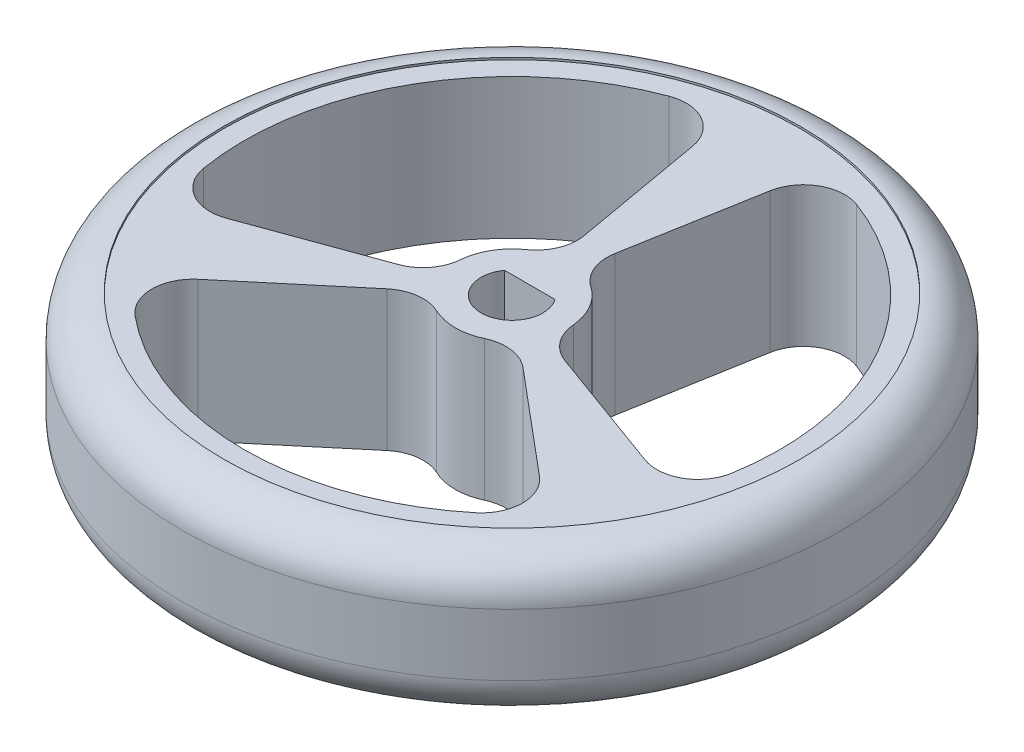
ISO-10303-21;
HEADER;
FILE_DESCRIPTION(('STEP AP214'),'2;1');
FILE_NAME('part.step','',(''),(''),'','','');
FILE_SCHEMA(('AUTOMOTIVE_DESIGN { 1 0 10303 214 1 1 1 1 }'));
ENDSEC;
DATA;
#1=APPLICATION_CONTEXT('core data for automotive mechanical design processes');
#2=APPLICATION_PROTOCOL_DEFINITION('international standard','automotive_design',2000,#1);
#3=PRODUCT_CONTEXT('',#1,'mechanical');
#4=PRODUCT('Part','Part','',(#3));
#5=PRODUCT_RELATED_PRODUCT_CATEGORY('part','',(#4));
#6=PRODUCT_DEFINITION_FORMATION('','',#4);
#7=PRODUCT_DEFINITION_CONTEXT('part definition',#1,'design');
#8=PRODUCT_DEFINITION('design','',#6,#7);
#9=PRODUCT_DEFINITION_SHAPE('','',#8);
#10=(LENGTH_UNIT() NAMED_UNIT(*) SI_UNIT(.MILLI.,.METRE.));
#11=(NAMED_UNIT(*) PLANE_ANGLE_UNIT() SI_UNIT($,.RADIAN.));
#12=(NAMED_UNIT(*) SI_UNIT($,.STERADIAN.) SOLID_ANGLE_UNIT());
#13=UNCERTAINTY_MEASURE_WITH_UNIT(LENGTH_MEASURE(1.E-05),#10,'distance_accuracy_value','');
#14=(GEOMETRIC_REPRESENTATION_CONTEXT(3) GLOBAL_UNCERTAINTY_ASSIGNED_CONTEXT((#13)) GLOBAL_UNIT_ASSIGNED_CONTEXT((#10,
#11,#12)) REPRESENTATION_CONTEXT('',''));
#15=CARTESIAN_POINT('',(0.,0.,0.));
#16=DIRECTION('',(0.,0.,1.));
#17=DIRECTION('',(1.,0.,0.));
#18=AXIS2_PLACEMENT_3D('',#15,#16,#17);
#19=CARTESIAN_POINT('',(0.,3.5,0.));
#20=DIRECTION('',(0.,-1.,0.));
#21=DIRECTION('',(0.,0.,-1.));
#22=AXIS2_PLACEMENT_3D('',#19,#20,#21);
#23=CYLINDRICAL_SURFACE('',#22,1.5);
#24=DIRECTION('',(0.,-1.,0.));
#25=VECTOR('',#24,1.);
#26=CARTESIAN_POINT('',(1.22723011289652,3.5,-0.8625));
#27=LINE('',#26,#25);
#28=CARTESIAN_POINT('',(1.22723011289652,3.4,-0.8625));
#29=VERTEX_POINT('',#28);
#30=CARTESIAN_POINT('',(1.22723011289652,-3.4,-0.8625));
#31=VERTEX_POINT('',#30);
#32=EDGE_CURVE('E373',#29,#31,#27,.T.);
#33=ORIENTED_EDGE('',*,*,#32,.T.);
#34=CARTESIAN_POINT('',(0.,-3.4,0.));
#35=DIRECTION('',(0.,-1.,0.));
#36=DIRECTION('',(0.,0.,-1.));
#37=AXIS2_PLACEMENT_3D('',#34,#35,#36);
#38=CIRCLE('',#37,1.5);
#39=CARTESIAN_POINT('',(-1.22723011289652,-3.4,-0.8625));
#40=VERTEX_POINT('',#39);
#41=EDGE_CURVE('E60',#31,#40,#38,.T.);
#42=ORIENTED_EDGE('',*,*,#41,.T.);
#43=DIRECTION('',(0.,-1.,0.));
#44=VECTOR('',#43,1.);
#45=CARTESIAN_POINT('',(-1.22723011289652,3.5,-0.8625));
#46=LINE('',#45,#44);
#47=CARTESIAN_POINT('',(-1.22723011289652,3.4,-0.8625));
#48=VERTEX_POINT('',#47);
#49=EDGE_CURVE('E376',#48,#40,#46,.T.);
#50=ORIENTED_EDGE('',*,*,#49,.F.);
#51=CARTESIAN_POINT('',(0.,3.4,0.));
#52=DIRECTION('',(0.,1.,0.));
#53=DIRECTION('',(0.,0.,1.));
#54=AXIS2_PLACEMENT_3D('',#51,#52,#53);
#55=CIRCLE('',#54,1.5);
#56=EDGE_CURVE('E370',#48,#29,#55,.T.);
#57=ORIENTED_EDGE('',*,*,#56,.T.);
#58=EDGE_LOOP('',(#33,#42,#50,#57));
#59=FACE_BOUND('',#58,.T.);
#60=ADVANCED_FACE('F46',(#59),#23,.F.);
#61=CARTESIAN_POINT('',(0.,3.5,0.));
#62=DIRECTION('',(0.,-1.,0.));
#63=DIRECTION('',(0.,0.,-1.));
#64=AXIS2_PLACEMENT_3D('',#61,#62,#63);
#65=CYLINDRICAL_SURFACE('',#64,2.75);
#66=CARTESIAN_POINT('',(0.,-3.4,0.));
#67=DIRECTION('',(0.,-1.,0.));
#68=DIRECTION('',(0.,0.,-1.));
#69=AXIS2_PLACEMENT_3D('',#66,#67,#68);
#70=CIRCLE('',#69,2.75);
#71=CARTESIAN_POINT('',(1.57344297134494,-3.4,-2.25538848448005));
#72=VERTEX_POINT('',#71);
#73=CARTESIAN_POINT('',(2.73994520863507,-3.4,-0.234947342350827));
#74=VERTEX_POINT('',#73);
#75=EDGE_CURVE('E424',#72,#74,#70,.T.);
#76=ORIENTED_EDGE('',*,*,#75,.F.);
#77=DIRECTION('',(0.,-1.,0.));
#78=VECTOR('',#77,1.);
#79=CARTESIAN_POINT('',(1.57344297134494,3.5,-2.25538848448005));
#80=LINE('',#79,#78);
#81=CARTESIAN_POINT('',(1.57344297134494,3.4,-2.25538848448005));
#82=VERTEX_POINT('',#81);
#83=EDGE_CURVE('E288',#72,#82,#80,.F.);
#84=ORIENTED_EDGE('',*,*,#83,.T.);
#85=CARTESIAN_POINT('',(0.,3.4,0.));
#86=DIRECTION('',(0.,1.,0.));
#87=DIRECTION('',(0.,0.,1.));
#88=AXIS2_PLACEMENT_3D('',#85,#86,#87);
#89=CIRCLE('',#88,2.75);
#90=CARTESIAN_POINT('',(2.73994520863507,3.4,-0.234947342350827));
#91=VERTEX_POINT('',#90);
#92=EDGE_CURVE('E363',#91,#82,#89,.T.);
#93=ORIENTED_EDGE('',*,*,#92,.F.);
#94=DIRECTION('',(0.,-1.,0.));
#95=VECTOR('',#94,1.);
#96=CARTESIAN_POINT('',(2.73994520863507,3.5,-0.234947342350827));
#97=LINE('',#96,#95);
#98=EDGE_CURVE('E290',#91,#74,#97,.T.);
#99=ORIENTED_EDGE('',*,*,#98,.T.);
#100=EDGE_LOOP('',(#76,#84,#93,#99));
#101=FACE_BOUND('',#100,.T.);
#102=ADVANCED_FACE('F483',(#101),#65,.T.);
#103=CARTESIAN_POINT('',(0.,3.5,0.));
#104=DIRECTION('',(-0.984807753012207,0.,-0.173648177666938));
#105=DIRECTION('',(-0.173648177666938,0.,0.984807753012207));
#106=AXIS2_PLACEMENT_3D('',#103,#104,#105);
#107=PLANE('',#106);
#108=DIRECTION('',(-0.173648177666938,0.,0.984807753012207));
#109=VECTOR('',#108,1.);
#110=CARTESIAN_POINT('',(0.,-3.4,0.));
#111=LINE('',#110,#109);
#112=CARTESIAN_POINT('',(1.87829222540707,-3.4,-10.65232454988));
#113=VERTEX_POINT('',#112);
#114=CARTESIAN_POINT('',(0.748149626298667,-3.4,-4.24296737398123));
#115=VERTEX_POINT('',#114);
#116=EDGE_CURVE('E426',#113,#115,#111,.T.);
#117=ORIENTED_EDGE('',*,*,#116,.F.);
#118=DIRECTION('',(0.,-1.,0.));
#119=VECTOR('',#118,1.);
#120=CARTESIAN_POINT('',(1.87829222540707,3.5,-10.65232454988));
#121=LINE('',#120,#119);
#122=CARTESIAN_POINT('',(1.87829222540707,3.4,-10.65232454988));
#123=VERTEX_POINT('',#122);
#124=EDGE_CURVE('E298',#113,#123,#121,.F.);
#125=ORIENTED_EDGE('',*,*,#124,.T.);
#126=DIRECTION('',(0.173648177666938,0.,-0.984807753012207));
#127=VECTOR('',#126,1.);
#128=CARTESIAN_POINT('',(0.,3.4,0.));
#129=LINE('',#128,#127);
#130=CARTESIAN_POINT('',(0.748149626298667,3.4,-4.24296737398123));
#131=VERTEX_POINT('',#130);
#132=EDGE_CURVE('E360',#131,#123,#129,.T.);
#133=ORIENTED_EDGE('',*,*,#132,.F.);
#134=DIRECTION('',(0.,1.,0.));
#135=VECTOR('',#134,1.);
#136=CARTESIAN_POINT('',(0.748149626298667,-3.5,-4.24296737398123));
#137=LINE('',#136,#135);
#138=EDGE_CURVE('E300',#131,#115,#137,.F.);
#139=ORIENTED_EDGE('',*,*,#138,.T.);
#140=EDGE_LOOP('',(#117,#125,#133,#139));
#141=FACE_BOUND('',#140,.T.);
#142=ADVANCED_FACE('F489',(#141),#107,.F.);
#143=CARTESIAN_POINT('',(0.,3.5,0.));
#144=DIRECTION('',(0.,-1.,0.));
#145=DIRECTION('',(0.,0.,-1.));
#146=AXIS2_PLACEMENT_3D('',#143,#144,#145);
#147=CYLINDRICAL_SURFACE('',#146,13.);
#148=DIRECTION('',(0.,-1.,0.));
#149=VECTOR('',#148,1.);
#150=CARTESIAN_POINT('',(4.54752731896448,3.5,-12.1786696844636));
#151=LINE('',#150,#149);
#152=CARTESIAN_POINT('',(4.54752731896448,3.4,-12.1786696844636));
#153=VERTEX_POINT('',#152);
#154=CARTESIAN_POINT('',(4.54752731896448,-3.4,-12.1786696844636));
#155=VERTEX_POINT('',#154);
#156=EDGE_CURVE('E305',#153,#155,#151,.T.);
#157=ORIENTED_EDGE('',*,*,#156,.T.);
#158=CARTESIAN_POINT('',(0.,-3.4,0.));
#159=DIRECTION('',(0.,-1.,0.));
#160=DIRECTION('',(0.,0.,-1.));
#161=AXIS2_PLACEMENT_3D('',#158,#159,#160);
#162=CIRCLE('',#161,13.);
#163=CARTESIAN_POINT('',(12.8208009905271,-3.4,2.15106065960479));
#164=VERTEX_POINT('',#163);
#165=EDGE_CURVE('E432',#155,#164,#162,.T.);
#166=ORIENTED_EDGE('',*,*,#165,.T.);
#167=DIRECTION('',(0.,-1.,0.));
#168=VECTOR('',#167,1.);
#169=CARTESIAN_POINT('',(12.8208009905271,3.5,2.15106065960479));
#170=LINE('',#169,#168);
#171=CARTESIAN_POINT('',(12.8208009905271,3.4,2.15106065960479));
#172=VERTEX_POINT('',#171);
#173=EDGE_CURVE('E303',#164,#172,#170,.F.);
#174=ORIENTED_EDGE('',*,*,#173,.T.);
#175=CARTESIAN_POINT('',(0.,3.4,0.));
#176=DIRECTION('',(0.,1.,0.));
#177=DIRECTION('',(0.,0.,1.));
#178=AXIS2_PLACEMENT_3D('',#175,#176,#177);
#179=CIRCLE('',#178,13.);
#180=EDGE_CURVE('E353',#172,#153,#179,.T.);
#181=ORIENTED_EDGE('',*,*,#180,.T.);
#182=EDGE_LOOP('',(#157,#166,#174,#181));
#183=FACE_BOUND('',#182,.T.);
#184=ADVANCED_FACE('F506',(#183),#147,.F.);
#185=CARTESIAN_POINT('',(0.,3.5,0.));
#186=DIRECTION('',(-0.984807753012209,0.,0.173648177666924));
#187=DIRECTION('',(0.173648177666924,0.,0.984807753012209));
#188=AXIS2_PLACEMENT_3D('',#185,#186,#187);
#189=PLANE('',#188);
#190=DIRECTION('',(0.,1.,0.));
#191=VECTOR('',#190,1.);
#192=CARTESIAN_POINT('',(-1.87829222540692,-3.5,-10.65232454988));
#193=LINE('',#192,#191);
#194=CARTESIAN_POINT('',(-1.87829222540692,3.4,-10.65232454988));
#195=VERTEX_POINT('',#194);
#196=CARTESIAN_POINT('',(-1.87829222540692,-3.4,-10.65232454988));
#197=VERTEX_POINT('',#196);
#198=EDGE_CURVE('E255',#195,#197,#193,.F.);
#199=ORIENTED_EDGE('',*,*,#198,.T.);
#200=DIRECTION('',(0.173648177666924,0.,0.984807753012209));
#201=VECTOR('',#200,1.);
#202=CARTESIAN_POINT('',(0.,-3.4,0.));
#203=LINE('',#202,#201);
#204=CARTESIAN_POINT('',(-0.748149626298607,-3.4,-4.24296737398124));
#205=VERTEX_POINT('',#204);
#206=EDGE_CURVE('E222',#197,#205,#203,.T.);
#207=ORIENTED_EDGE('',*,*,#206,.T.);
#208=DIRECTION('',(0.,-1.,0.));
#209=VECTOR('',#208,1.);
#210=CARTESIAN_POINT('',(-0.748149626298607,3.5,-4.24296737398124));
#211=LINE('',#210,#209);
#212=CARTESIAN_POINT('',(-0.748149626298607,3.4,-4.24296737398124));
#213=VERTEX_POINT('',#212);
#214=EDGE_CURVE('E257',#205,#213,#211,.F.);
#215=ORIENTED_EDGE('',*,*,#214,.T.);
#216=DIRECTION('',(-0.173648177666924,0.,-0.984807753012209));
#217=VECTOR('',#216,1.);
#218=CARTESIAN_POINT('',(0.,3.4,0.));
#219=LINE('',#218,#217);
#220=EDGE_CURVE('E250',#213,#195,#219,.T.);
#221=ORIENTED_EDGE('',*,*,#220,.T.);
#222=EDGE_LOOP('',(#199,#207,#215,#221));
#223=FACE_BOUND('',#222,.T.);
#224=ADVANCED_FACE('F254',(#223),#189,.T.);
#225=CARTESIAN_POINT('',(0.,-3.4,0.));
#226=DIRECTION('',(0.,-1.,0.));
#227=DIRECTION('',(0.,0.,-1.));
#228=AXIS2_PLACEMENT_3D('',#225,#226,#227);
#229=CIRCLE('',#228,2.75);
#230=CARTESIAN_POINT('',(-2.73994520863508,-3.4,-0.234947342350669));
#231=VERTEX_POINT('',#230);
#232=CARTESIAN_POINT('',(-1.57344297134491,-3.4,-2.25538848448007));
#233=VERTEX_POINT('',#232);
#234=EDGE_CURVE('E391',#231,#233,#229,.T.);
#235=ORIENTED_EDGE('',*,*,#234,.F.);
#236=DIRECTION('',(0.,-1.,0.));
#237=VECTOR('',#236,1.);
#238=CARTESIAN_POINT('',(-2.73994520863508,3.5,-0.234947342350669));
#239=LINE('',#238,#237);
#240=CARTESIAN_POINT('',(-2.73994520863508,3.4,-0.234947342350669));
#241=VERTEX_POINT('',#240);
#242=EDGE_CURVE('E265',#231,#241,#239,.F.);
#243=ORIENTED_EDGE('',*,*,#242,.T.);
#244=CARTESIAN_POINT('',(0.,3.4,0.));
#245=DIRECTION('',(0.,1.,0.));
#246=DIRECTION('',(0.,0.,1.));
#247=AXIS2_PLACEMENT_3D('',#244,#245,#246);
#248=CIRCLE('',#247,2.75);
#249=CARTESIAN_POINT('',(-1.57344297134491,3.4,-2.25538848448007));
#250=VERTEX_POINT('',#249);
#251=EDGE_CURVE('E333',#250,#241,#248,.T.);
#252=ORIENTED_EDGE('',*,*,#251,.F.);
#253=DIRECTION('',(0.,-1.,0.));
#254=VECTOR('',#253,1.);
#255=CARTESIAN_POINT('',(-1.57344297134491,3.5,-2.25538848448007));
#256=LINE('',#255,#254);
#257=EDGE_CURVE('E260',#250,#233,#256,.T.);
#258=ORIENTED_EDGE('',*,*,#257,.T.);
#259=EDGE_LOOP('',(#235,#243,#252,#258));
#260=FACE_BOUND('',#259,.T.);
#261=ADVANCED_FACE('F389',(#260),#65,.T.);
#262=CARTESIAN_POINT('',(0.,3.5,1.4569079967223E-13));
#263=DIRECTION('',(0.342020143325662,0.,0.939692620785911));
#264=DIRECTION('',(0.939692620785911,0.,-0.342020143325662));
#265=AXIS2_PLACEMENT_3D('',#262,#263,#264);
#266=PLANE('',#265);
#267=DIRECTION('',(0.939692620785911,0.,-0.342020143325662));
#268=VECTOR('',#267,1.);
#269=CARTESIAN_POINT('',(0.,-3.4,1.4569079967223E-13));
#270=LINE('',#269,#268);
#271=CARTESIAN_POINT('',(-10.1643297822562,-3.4,3.6995134920068));
#272=VERTEX_POINT('',#271);
#273=CARTESIAN_POINT('',(-4.04859234644564,-3.4,1.4735671047843));
#274=VERTEX_POINT('',#273);
#275=EDGE_CURVE('E405',#272,#274,#270,.T.);
#276=ORIENTED_EDGE('',*,*,#275,.F.);
#277=DIRECTION('',(0.,-1.,0.));
#278=VECTOR('',#277,1.);
#279=CARTESIAN_POINT('',(-10.1643297822562,3.5,3.6995134920068));
#280=LINE('',#279,#278);
#281=CARTESIAN_POINT('',(-10.1643297822562,3.4,3.6995134920068));
#282=VERTEX_POINT('',#281);
#283=EDGE_CURVE('E262',#272,#282,#280,.F.);
#284=ORIENTED_EDGE('',*,*,#283,.T.);
#285=DIRECTION('',(-0.939692620785911,0.,0.342020143325662));
#286=VECTOR('',#285,1.);
#287=CARTESIAN_POINT('',(0.,3.4,1.4569079967223E-13));
#288=LINE('',#287,#286);
#289=CARTESIAN_POINT('',(-4.04859234644564,3.4,1.4735671047843));
#290=VERTEX_POINT('',#289);
#291=EDGE_CURVE('E398',#290,#282,#288,.T.);
#292=ORIENTED_EDGE('',*,*,#291,.F.);
#293=DIRECTION('',(0.,1.,0.));
#294=VECTOR('',#293,1.);
#295=CARTESIAN_POINT('',(-4.04859234644564,-3.5,1.4735671047843));
#296=LINE('',#295,#294);
#297=EDGE_CURVE('E270',#290,#274,#296,.F.);
#298=ORIENTED_EDGE('',*,*,#297,.T.);
#299=EDGE_LOOP('',(#276,#284,#292,#298));
#300=FACE_BOUND('',#299,.T.);
#301=ADVANCED_FACE('F404',(#300),#266,.F.);
#302=CARTESIAN_POINT('',(1.21820169157485E-13,3.5,1.45179624243869E-13));
#303=DIRECTION('',(0.642787609686534,0.,0.766044443118982));
#304=DIRECTION('',(0.766044443118982,0.,-0.642787609686534));
#305=AXIS2_PLACEMENT_3D('',#302,#303,#304);
#306=PLANE('',#305);
#307=DIRECTION('',(0.,1.,0.));
#308=VECTOR('',#307,1.);
#309=CARTESIAN_POINT('',(-8.2860375568491,-3.5,6.95281105787332));
#310=LINE('',#309,#308);
#311=CARTESIAN_POINT('',(-8.2860375568491,3.4,6.95281105787332));
#312=VERTEX_POINT('',#311);
#313=CARTESIAN_POINT('',(-8.2860375568491,-3.4,6.95281105787332));
#314=VERTEX_POINT('',#313);
#315=EDGE_CURVE('E278',#312,#314,#310,.F.);
#316=ORIENTED_EDGE('',*,*,#315,.T.);
#317=DIRECTION('',(0.766044443118982,0.,-0.642787609686534));
#318=VECTOR('',#317,1.);
#319=CARTESIAN_POINT('',(1.21820169157485E-13,-3.4,1.45179624243869E-13));
#320=LINE('',#319,#318);
#321=CARTESIAN_POINT('',(-3.30044272014681,-3.4,2.76940026919714));
#322=VERTEX_POINT('',#321);
#323=EDGE_CURVE('E448',#314,#322,#320,.T.);
#324=ORIENTED_EDGE('',*,*,#323,.T.);
#325=DIRECTION('',(0.,-1.,0.));
#326=VECTOR('',#325,1.);
#327=CARTESIAN_POINT('',(-3.30044272014681,3.5,2.76940026919714));
#328=LINE('',#327,#326);
#329=CARTESIAN_POINT('',(-3.30044272014681,3.4,2.76940026919714));
#330=VERTEX_POINT('',#329);
#331=EDGE_CURVE('E281',#322,#330,#328,.F.);
#332=ORIENTED_EDGE('',*,*,#331,.T.);
#333=DIRECTION('',(-0.766044443118982,0.,0.642787609686534));
#334=VECTOR('',#333,1.);
#335=CARTESIAN_POINT('',(1.21820169157485E-13,3.4,1.45179624243869E-13));
#336=LINE('',#335,#334);
#337=EDGE_CURVE('E327',#330,#312,#336,.T.);
#338=ORIENTED_EDGE('',*,*,#337,.T.);
#339=EDGE_LOOP('',(#316,#324,#332,#338));
#340=FACE_BOUND('',#339,.T.);
#341=ADVANCED_FACE('F515',(#340),#306,.T.);
#342=CARTESIAN_POINT('',(0.,-3.4,0.));
#343=DIRECTION('',(0.,-1.,0.));
#344=DIRECTION('',(0.,0.,-1.));
#345=AXIS2_PLACEMENT_3D('',#342,#343,#344);
#346=CIRCLE('',#345,2.75);
#347=CARTESIAN_POINT('',(1.16650223729025,-3.4,2.49033582683076));
#348=VERTEX_POINT('',#347);
#349=CARTESIAN_POINT('',(-1.16650223729006,-3.4,2.49033582683085));
#350=VERTEX_POINT('',#349);
#351=EDGE_CURVE('E440',#348,#350,#346,.T.);
#352=ORIENTED_EDGE('',*,*,#351,.F.);
#353=DIRECTION('',(0.,-1.,0.));
#354=VECTOR('',#353,1.);
#355=CARTESIAN_POINT('',(1.16650223729025,3.5,2.49033582683076));
#356=LINE('',#355,#354);
#357=CARTESIAN_POINT('',(1.16650223729025,3.4,2.49033582683076));
#358=VERTEX_POINT('',#357);
#359=EDGE_CURVE('E273',#348,#358,#356,.F.);
#360=ORIENTED_EDGE('',*,*,#359,.T.);
#361=CARTESIAN_POINT('',(0.,3.4,0.));
#362=DIRECTION('',(0.,1.,0.));
#363=DIRECTION('',(0.,0.,1.));
#364=AXIS2_PLACEMENT_3D('',#361,#362,#363);
#365=CIRCLE('',#364,2.75);
#366=CARTESIAN_POINT('',(-1.16650223729006,3.4,2.49033582683085));
#367=VERTEX_POINT('',#366);
#368=EDGE_CURVE('E343',#367,#358,#365,.T.);
#369=ORIENTED_EDGE('',*,*,#368,.F.);
#370=DIRECTION('',(0.,-1.,0.));
#371=VECTOR('',#370,1.);
#372=CARTESIAN_POINT('',(-1.16650223729006,3.5,2.49033582683085));
#373=LINE('',#372,#371);
#374=EDGE_CURVE('E275',#367,#350,#373,.T.);
#375=ORIENTED_EDGE('',*,*,#374,.T.);
#376=EDGE_LOOP('',(#352,#360,#369,#375));
#377=FACE_BOUND('',#376,.T.);
#378=ADVANCED_FACE('F492',(#377),#65,.T.);
#379=CARTESIAN_POINT('',(1.22377698535782E-13,3.5,-1.45844061883427E-13));
#380=DIRECTION('',(0.642787609686545,0.,-0.766044443118973));
#381=DIRECTION('',(-0.766044443118973,0.,-0.642787609686545));
#382=AXIS2_PLACEMENT_3D('',#379,#380,#381);
#383=PLANE('',#382);
#384=DIRECTION('',(-0.766044443118973,0.,-0.642787609686545));
#385=VECTOR('',#384,1.);
#386=CARTESIAN_POINT('',(1.22377698535782E-13,-3.4,-1.45844061883427E-13));
#387=LINE('',#386,#385);
#388=CARTESIAN_POINT('',(8.2860375568493,-3.4,6.95281105787319));
#389=VERTEX_POINT('',#388);
#390=CARTESIAN_POINT('',(3.30044272014715,-3.4,2.769400269197));
#391=VERTEX_POINT('',#390);
#392=EDGE_CURVE('E442',#389,#391,#387,.T.);
#393=ORIENTED_EDGE('',*,*,#392,.F.);
#394=DIRECTION('',(0.,-1.,0.));
#395=VECTOR('',#394,1.);
#396=CARTESIAN_POINT('',(8.2860375568493,3.5,6.95281105787319));
#397=LINE('',#396,#395);
#398=CARTESIAN_POINT('',(8.2860375568493,3.4,6.95281105787319));
#399=VERTEX_POINT('',#398);
#400=EDGE_CURVE('E283',#389,#399,#397,.F.);
#401=ORIENTED_EDGE('',*,*,#400,.T.);
#402=DIRECTION('',(0.766044443118973,0.,0.642787609686545));
#403=VECTOR('',#402,1.);
#404=CARTESIAN_POINT('',(1.22377698535782E-13,3.4,-1.45844061883427E-13));
#405=LINE('',#404,#403);
#406=CARTESIAN_POINT('',(3.30044272014715,3.4,2.769400269197));
#407=VERTEX_POINT('',#406);
#408=EDGE_CURVE('E341',#407,#399,#405,.T.);
#409=ORIENTED_EDGE('',*,*,#408,.F.);
#410=DIRECTION('',(0.,1.,0.));
#411=VECTOR('',#410,1.);
#412=CARTESIAN_POINT('',(3.30044272014715,-3.5,2.769400269197));
#413=LINE('',#412,#411);
#414=EDGE_CURVE('E285',#407,#391,#413,.F.);
#415=ORIENTED_EDGE('',*,*,#414,.T.);
#416=EDGE_LOOP('',(#393,#401,#409,#415));
#417=FACE_BOUND('',#416,.T.);
#418=ADVANCED_FACE('F504',(#417),#383,.F.);
#419=CARTESIAN_POINT('',(0.,3.5,-1.45181391281766E-13));
#420=DIRECTION('',(0.342020143325675,0.,-0.939692620785906));
#421=DIRECTION('',(-0.939692620785906,0.,-0.342020143325675));
#422=AXIS2_PLACEMENT_3D('',#419,#420,#421);
#423=PLANE('',#422);
#424=DIRECTION('',(0.,1.,0.));
#425=VECTOR('',#424,1.);
#426=CARTESIAN_POINT('',(10.1643297822562,-3.5,3.69951349200664));
#427=LINE('',#426,#425);
#428=CARTESIAN_POINT('',(10.1643297822562,3.4,3.69951349200664));
#429=VERTEX_POINT('',#428);
#430=CARTESIAN_POINT('',(10.1643297822562,-3.4,3.69951349200664));
#431=VERTEX_POINT('',#430);
#432=EDGE_CURVE('E293',#429,#431,#427,.F.);
#433=ORIENTED_EDGE('',*,*,#432,.T.);
#434=DIRECTION('',(-0.939692620785906,0.,-0.342020143325675));
#435=VECTOR('',#434,1.);
#436=CARTESIAN_POINT('',(0.,-3.4,-1.45181391281766E-13));
#437=LINE('',#436,#435);
#438=CARTESIAN_POINT('',(4.04859234644559,-3.4,1.47356710478402));
#439=VERTEX_POINT('',#438);
#440=EDGE_CURVE('E68',#431,#439,#437,.T.);
#441=ORIENTED_EDGE('',*,*,#440,.T.);
#442=DIRECTION('',(0.,-1.,0.));
#443=VECTOR('',#442,1.);
#444=CARTESIAN_POINT('',(4.04859234644559,3.5,1.47356710478402));
#445=LINE('',#444,#443);
#446=CARTESIAN_POINT('',(4.04859234644559,3.4,1.47356710478402));
#447=VERTEX_POINT('',#446);
#448=EDGE_CURVE('E296',#439,#447,#445,.F.);
#449=ORIENTED_EDGE('',*,*,#448,.T.);
#450=DIRECTION('',(0.939692620785906,0.,0.342020143325675));
#451=VECTOR('',#450,1.);
#452=CARTESIAN_POINT('',(0.,3.4,-1.45181391281766E-13));
#453=LINE('',#452,#451);
#454=EDGE_CURVE('E350',#447,#429,#453,.T.);
#455=ORIENTED_EDGE('',*,*,#454,.T.);
#456=EDGE_LOOP('',(#433,#441,#449,#455));
#457=FACE_BOUND('',#456,.T.);
#458=ADVANCED_FACE('F501',(#457),#423,.T.);
#459=DIRECTION('',(0.,-1.,0.));
#460=VECTOR('',#459,1.);
#461=CARTESIAN_POINT('',(-12.8208009905271,3.5,2.15106065960498));
#462=LINE('',#461,#460);
#463=CARTESIAN_POINT('',(-12.8208009905271,3.4,2.15106065960498));
#464=VERTEX_POINT('',#463);
#465=CARTESIAN_POINT('',(-12.8208009905271,-3.4,2.15106065960498));
#466=VERTEX_POINT('',#465);
#467=EDGE_CURVE('E234',#464,#466,#462,.T.);
#468=ORIENTED_EDGE('',*,*,#467,.T.);
#469=CARTESIAN_POINT('',(0.,-3.4,0.));
#470=DIRECTION('',(0.,-1.,0.));
#471=DIRECTION('',(0.,0.,-1.));
#472=AXIS2_PLACEMENT_3D('',#469,#470,#471);
#473=CIRCLE('',#472,13.);
#474=CARTESIAN_POINT('',(-4.54752731896431,-3.4,-12.1786696844636));
#475=VERTEX_POINT('',#474);
#476=EDGE_CURVE('E219',#466,#475,#473,.T.);
#477=ORIENTED_EDGE('',*,*,#476,.T.);
#478=DIRECTION('',(0.,-1.,0.));
#479=VECTOR('',#478,1.);
#480=CARTESIAN_POINT('',(-4.54752731896431,3.5,-12.1786696844636));
#481=LINE('',#480,#479);
#482=CARTESIAN_POINT('',(-4.54752731896431,3.4,-12.1786696844636));
#483=VERTEX_POINT('',#482);
#484=EDGE_CURVE('E231',#475,#483,#481,.F.);
#485=ORIENTED_EDGE('',*,*,#484,.T.);
#486=CARTESIAN_POINT('',(0.,3.4,0.));
#487=DIRECTION('',(0.,1.,0.));
#488=DIRECTION('',(0.,0.,1.));
#489=AXIS2_PLACEMENT_3D('',#486,#487,#488);
#490=CIRCLE('',#489,13.);
#491=EDGE_CURVE('E252',#483,#464,#490,.T.);
#492=ORIENTED_EDGE('',*,*,#491,.T.);
#493=EDGE_LOOP('',(#468,#477,#485,#492));
#494=FACE_BOUND('',#493,.T.);
#495=ADVANCED_FACE('F229',(#494),#147,.F.);
#496=DIRECTION('',(0.,-1.,0.));
#497=VECTOR('',#496,1.);
#498=CARTESIAN_POINT('',(8.27327367156279,3.5,10.0276090248586));
#499=LINE('',#498,#497);
#500=CARTESIAN_POINT('',(8.27327367156279,3.4,10.0276090248586));
#501=VERTEX_POINT('',#500);
#502=CARTESIAN_POINT('',(8.27327367156279,-3.4,10.0276090248586));
#503=VERTEX_POINT('',#502);
#504=EDGE_CURVE('E238',#501,#503,#499,.T.);
#505=ORIENTED_EDGE('',*,*,#504,.T.);
#506=CARTESIAN_POINT('',(0.,-3.4,0.));
#507=DIRECTION('',(0.,-1.,0.));
#508=DIRECTION('',(0.,0.,-1.));
#509=AXIS2_PLACEMENT_3D('',#506,#507,#508);
#510=CIRCLE('',#509,13.);
#511=CARTESIAN_POINT('',(-8.27327367156258,-3.4,10.0276090248588));
#512=VERTEX_POINT('',#511);
#513=EDGE_CURVE('E315',#503,#512,#510,.T.);
#514=ORIENTED_EDGE('',*,*,#513,.T.);
#515=DIRECTION('',(0.,-1.,0.));
#516=VECTOR('',#515,1.);
#517=CARTESIAN_POINT('',(-8.27327367156258,3.5,10.0276090248588));
#518=LINE('',#517,#516);
#519=CARTESIAN_POINT('',(-8.27327367156258,3.4,10.0276090248588));
#520=VERTEX_POINT('',#519);
#521=EDGE_CURVE('E242',#512,#520,#518,.F.);
#522=ORIENTED_EDGE('',*,*,#521,.T.);
#523=CARTESIAN_POINT('',(0.,3.4,0.));
#524=DIRECTION('',(0.,1.,0.));
#525=DIRECTION('',(0.,0.,1.));
#526=AXIS2_PLACEMENT_3D('',#523,#524,#525);
#527=CIRCLE('',#526,13.);
#528=EDGE_CURVE('E313',#520,#501,#527,.T.);
#529=ORIENTED_EDGE('',*,*,#528,.T.);
#530=EDGE_LOOP('',(#505,#514,#522,#529));
#531=FACE_BOUND('',#530,.T.);
#532=ADVANCED_FACE('F312',(#531),#147,.F.);
#533=CARTESIAN_POINT('',(0.,3.5,-0.8625));
#534=DIRECTION('',(0.,0.,-1.));
#535=DIRECTION('',(-1.,0.,0.));
#536=AXIS2_PLACEMENT_3D('',#533,#534,#535);
#537=PLANE('',#536);
#538=DIRECTION('',(-1.,0.,0.));
#539=VECTOR('',#538,1.);
#540=CARTESIAN_POINT('',(0.,-3.4,-0.8625));
#541=LINE('',#540,#539);
#542=EDGE_CURVE('E420',#31,#40,#541,.T.);
#543=ORIENTED_EDGE('',*,*,#542,.F.);
#544=ORIENTED_EDGE('',*,*,#32,.F.);
#545=DIRECTION('',(1.,0.,0.));
#546=VECTOR('',#545,1.);
#547=CARTESIAN_POINT('',(0.,3.4,-0.8625));
#548=LINE('',#547,#546);
#549=EDGE_CURVE('E368',#48,#29,#548,.T.);
#550=ORIENTED_EDGE('',*,*,#549,.F.);
#551=ORIENTED_EDGE('',*,*,#49,.T.);
#552=EDGE_LOOP('',(#543,#544,#550,#551));
#553=FACE_BOUND('',#552,.T.);
#554=ADVANCED_FACE('F495',(#553),#537,.F.);
#555=CARTESIAN_POINT('',(-2.71776513232303,3.5,-3.89567101864739));
#556=DIRECTION('',(0.,-1.,0.));
#557=DIRECTION('',(0.,0.,-1.));
#558=AXIS2_PLACEMENT_3D('',#555,#556,#557);
#559=CYLINDRICAL_SURFACE('',#558,2.);
#560=CARTESIAN_POINT('',(-2.71776513232303,-3.4,-3.89567101864739));
#561=DIRECTION('',(0.,-1.,0.));
#562=DIRECTION('',(0.,0.,-1.));
#563=AXIS2_PLACEMENT_3D('',#560,#561,#562);
#564=CIRCLE('',#563,2.);
#565=EDGE_CURVE('E457',#233,#205,#564,.F.);
#566=ORIENTED_EDGE('',*,*,#565,.F.);
#567=ORIENTED_EDGE('',*,*,#257,.F.);
#568=CARTESIAN_POINT('',(-2.71776513232303,3.4,-3.89567101864739));
#569=DIRECTION('',(0.,1.,0.));
#570=DIRECTION('',(0.,0.,1.));
#571=AXIS2_PLACEMENT_3D('',#568,#569,#570);
#572=CIRCLE('',#571,2.);
#573=EDGE_CURVE('E397',#213,#250,#572,.F.);
#574=ORIENTED_EDGE('',*,*,#573,.F.);
#575=ORIENTED_EDGE('',*,*,#214,.F.);
#576=EDGE_LOOP('',(#566,#567,#574,#575));
#577=FACE_BOUND('',#576,.T.);
#578=ADVANCED_FACE('F531',(#577),#559,.F.);
#579=CARTESIAN_POINT('',(-4.73263263309696,3.5,-0.405818136787518));
#580=DIRECTION('',(0.,-1.,0.));
#581=DIRECTION('',(0.,0.,-1.));
#582=AXIS2_PLACEMENT_3D('',#579,#580,#581);
#583=CYLINDRICAL_SURFACE('',#582,2.);
#584=CARTESIAN_POINT('',(-4.73263263309696,-3.4,-0.405818136787518));
#585=DIRECTION('',(0.,-1.,0.));
#586=DIRECTION('',(0.,0.,-1.));
#587=AXIS2_PLACEMENT_3D('',#584,#585,#586);
#588=CIRCLE('',#587,2.);
#589=EDGE_CURVE('E401',#274,#231,#588,.F.);
#590=ORIENTED_EDGE('',*,*,#589,.F.);
#591=ORIENTED_EDGE('',*,*,#297,.F.);
#592=CARTESIAN_POINT('',(-4.73263263309696,3.4,-0.405818136787518));
#593=DIRECTION('',(0.,1.,0.));
#594=DIRECTION('',(0.,0.,1.));
#595=AXIS2_PLACEMENT_3D('',#592,#593,#594);
#596=CIRCLE('',#595,2.);
#597=EDGE_CURVE('E331',#241,#290,#596,.F.);
#598=ORIENTED_EDGE('',*,*,#597,.F.);
#599=ORIENTED_EDGE('',*,*,#242,.F.);
#600=EDGE_LOOP('',(#590,#591,#598,#599));
#601=FACE_BOUND('',#600,.T.);
#602=ADVANCED_FACE('F400',(#601),#583,.F.);
#603=CARTESIAN_POINT('',(-2.01486750077374,3.5,4.3014891554351));
#604=DIRECTION('',(0.,-1.,0.));
#605=DIRECTION('',(0.,0.,-1.));
#606=AXIS2_PLACEMENT_3D('',#603,#604,#605);
#607=CYLINDRICAL_SURFACE('',#606,2.);
#608=CARTESIAN_POINT('',(-2.01486750077374,-3.4,4.3014891554351));
#609=DIRECTION('',(0.,-1.,0.));
#610=DIRECTION('',(0.,0.,-1.));
#611=AXIS2_PLACEMENT_3D('',#608,#609,#610);
#612=CIRCLE('',#611,2.);
#613=EDGE_CURVE('E444',#350,#322,#612,.F.);
#614=ORIENTED_EDGE('',*,*,#613,.F.);
#615=ORIENTED_EDGE('',*,*,#374,.F.);
#616=CARTESIAN_POINT('',(-2.01486750077374,3.4,4.3014891554351));
#617=DIRECTION('',(0.,1.,0.));
#618=DIRECTION('',(0.,0.,1.));
#619=AXIS2_PLACEMENT_3D('',#616,#617,#618);
#620=CIRCLE('',#619,2.);
#621=EDGE_CURVE('E339',#330,#367,#620,.F.);
#622=ORIENTED_EDGE('',*,*,#621,.F.);
#623=ORIENTED_EDGE('',*,*,#331,.F.);
#624=EDGE_LOOP('',(#614,#615,#622,#623));
#625=FACE_BOUND('',#624,.T.);
#626=ADVANCED_FACE('F537',(#625),#607,.F.);
#627=CARTESIAN_POINT('',(2.01486750077406,3.5,4.30148915543495));
#628=DIRECTION('',(0.,-1.,0.));
#629=DIRECTION('',(0.,0.,-1.));
#630=AXIS2_PLACEMENT_3D('',#627,#628,#629);
#631=CYLINDRICAL_SURFACE('',#630,2.);
#632=CARTESIAN_POINT('',(2.01486750077406,-3.4,4.30148915543495));
#633=DIRECTION('',(0.,-1.,0.));
#634=DIRECTION('',(0.,0.,-1.));
#635=AXIS2_PLACEMENT_3D('',#632,#633,#634);
#636=CIRCLE('',#635,2.);
#637=EDGE_CURVE('E438',#391,#348,#636,.F.);
#638=ORIENTED_EDGE('',*,*,#637,.F.);
#639=ORIENTED_EDGE('',*,*,#414,.F.);
#640=CARTESIAN_POINT('',(2.01486750077406,3.4,4.30148915543495));
#641=DIRECTION('',(0.,1.,0.));
#642=DIRECTION('',(0.,0.,1.));
#643=AXIS2_PLACEMENT_3D('',#640,#641,#642);
#644=CIRCLE('',#643,2.);
#645=EDGE_CURVE('E346',#358,#407,#644,.F.);
#646=ORIENTED_EDGE('',*,*,#645,.F.);
#647=ORIENTED_EDGE('',*,*,#359,.F.);
#648=EDGE_LOOP('',(#638,#639,#646,#647));
#649=FACE_BOUND('',#648,.T.);
#650=ADVANCED_FACE('F540',(#649),#631,.F.);
#651=CARTESIAN_POINT('',(4.73263263309694,3.5,-0.405818136787792));
#652=DIRECTION('',(0.,-1.,0.));
#653=DIRECTION('',(0.,0.,-1.));
#654=AXIS2_PLACEMENT_3D('',#651,#652,#653);
#655=CYLINDRICAL_SURFACE('',#654,2.);
#656=CARTESIAN_POINT('',(4.73263263309694,-3.4,-0.405818136787792));
#657=DIRECTION('',(0.,-1.,0.));
#658=DIRECTION('',(0.,0.,-1.));
#659=AXIS2_PLACEMENT_3D('',#656,#657,#658);
#660=CIRCLE('',#659,2.);
#661=EDGE_CURVE('E428',#74,#439,#660,.F.);
#662=ORIENTED_EDGE('',*,*,#661,.F.);
#663=ORIENTED_EDGE('',*,*,#98,.F.);
#664=CARTESIAN_POINT('',(4.73263263309694,3.4,-0.405818136787792));
#665=DIRECTION('',(0.,1.,0.));
#666=DIRECTION('',(0.,0.,1.));
#667=AXIS2_PLACEMENT_3D('',#664,#665,#666);
#668=CIRCLE('',#667,2.);
#669=EDGE_CURVE('E358',#447,#91,#668,.F.);
#670=ORIENTED_EDGE('',*,*,#669,.F.);
#671=ORIENTED_EDGE('',*,*,#448,.F.);
#672=EDGE_LOOP('',(#662,#663,#670,#671));
#673=FACE_BOUND('',#672,.T.);
#674=ADVANCED_FACE('F544',(#673),#655,.F.);
#675=CARTESIAN_POINT('',(2.71776513232308,3.5,-3.89567101864735));
#676=DIRECTION('',(0.,-1.,0.));
#677=DIRECTION('',(0.,0.,-1.));
#678=AXIS2_PLACEMENT_3D('',#675,#676,#677);
#679=CYLINDRICAL_SURFACE('',#678,2.);
#680=CARTESIAN_POINT('',(2.71776513232308,-3.4,-3.89567101864735));
#681=DIRECTION('',(0.,-1.,0.));
#682=DIRECTION('',(0.,0.,-1.));
#683=AXIS2_PLACEMENT_3D('',#680,#681,#682);
#684=CIRCLE('',#683,2.);
#685=EDGE_CURVE('E422',#115,#72,#684,.F.);
#686=ORIENTED_EDGE('',*,*,#685,.F.);
#687=ORIENTED_EDGE('',*,*,#138,.F.);
#688=CARTESIAN_POINT('',(2.71776513232308,3.4,-3.89567101864735));
#689=DIRECTION('',(0.,1.,0.));
#690=DIRECTION('',(0.,0.,1.));
#691=AXIS2_PLACEMENT_3D('',#688,#689,#690);
#692=CIRCLE('',#691,2.);
#693=EDGE_CURVE('E366',#82,#131,#692,.F.);
#694=ORIENTED_EDGE('',*,*,#693,.F.);
#695=ORIENTED_EDGE('',*,*,#83,.F.);
#696=EDGE_LOOP('',(#686,#687,#694,#695));
#697=FACE_BOUND('',#696,.T.);
#698=ADVANCED_FACE('F548',(#697),#679,.F.);
#699=CARTESIAN_POINT('',(3.84790773143149,3.5,-10.3050281945461));
#700=DIRECTION('',(0.,-1.,0.));
#701=DIRECTION('',(0.,0.,-1.));
#702=AXIS2_PLACEMENT_3D('',#699,#700,#701);
#703=CYLINDRICAL_SURFACE('',#702,2.);
#704=CARTESIAN_POINT('',(3.84790773143149,-3.4,-10.3050281945461));
#705=DIRECTION('',(0.,-1.,0.));
#706=DIRECTION('',(0.,0.,-1.));
#707=AXIS2_PLACEMENT_3D('',#704,#705,#706);
#708=CIRCLE('',#707,2.);
#709=EDGE_CURVE('E430',#155,#113,#708,.F.);
#710=ORIENTED_EDGE('',*,*,#709,.F.);
#711=ORIENTED_EDGE('',*,*,#156,.F.);
#712=CARTESIAN_POINT('',(3.84790773143149,3.4,-10.3050281945461));
#713=DIRECTION('',(0.,1.,0.));
#714=DIRECTION('',(0.,0.,1.));
#715=AXIS2_PLACEMENT_3D('',#712,#713,#714);
#716=CIRCLE('',#715,2.);
#717=EDGE_CURVE('E356',#123,#153,#716,.F.);
#718=ORIENTED_EDGE('',*,*,#717,.F.);
#719=ORIENTED_EDGE('',*,*,#124,.F.);
#720=EDGE_LOOP('',(#710,#711,#718,#719));
#721=FACE_BOUND('',#720,.T.);
#722=ADVANCED_FACE('F552',(#721),#703,.F.);
#723=CARTESIAN_POINT('',(10.8483700689075,3.5,1.82012825043482));
#724=DIRECTION('',(0.,-1.,0.));
#725=DIRECTION('',(0.,0.,-1.));
#726=AXIS2_PLACEMENT_3D('',#723,#724,#725);
#727=CYLINDRICAL_SURFACE('',#726,2.);
#728=CARTESIAN_POINT('',(10.8483700689075,-3.4,1.82012825043482));
#729=DIRECTION('',(0.,-1.,0.));
#730=DIRECTION('',(0.,0.,-1.));
#731=AXIS2_PLACEMENT_3D('',#728,#729,#730);
#732=CIRCLE('',#731,2.);
#733=EDGE_CURVE('E436',#431,#164,#732,.F.);
#734=ORIENTED_EDGE('',*,*,#733,.F.);
#735=ORIENTED_EDGE('',*,*,#432,.F.);
#736=CARTESIAN_POINT('',(10.8483700689075,3.4,1.82012825043482));
#737=DIRECTION('',(0.,1.,0.));
#738=DIRECTION('',(0.,0.,1.));
#739=AXIS2_PLACEMENT_3D('',#736,#737,#738);
#740=CIRCLE('',#739,2.);
#741=EDGE_CURVE('E348',#172,#429,#740,.F.);
#742=ORIENTED_EDGE('',*,*,#741,.F.);
#743=ORIENTED_EDGE('',*,*,#173,.F.);
#744=EDGE_LOOP('',(#734,#735,#742,#743));
#745=FACE_BOUND('',#744,.T.);
#746=ADVANCED_FACE('F556',(#745),#727,.F.);
#747=CARTESIAN_POINT('',(7.00046233747621,3.5,8.48489994411114));
#748=DIRECTION('',(0.,-1.,0.));
#749=DIRECTION('',(0.,0.,-1.));
#750=AXIS2_PLACEMENT_3D('',#747,#748,#749);
#751=CYLINDRICAL_SURFACE('',#750,2.);
#752=CARTESIAN_POINT('',(7.00046233747621,-3.4,8.48489994411114));
#753=DIRECTION('',(0.,-1.,0.));
#754=DIRECTION('',(0.,0.,-1.));
#755=AXIS2_PLACEMENT_3D('',#752,#753,#754);
#756=CIRCLE('',#755,2.);
#757=EDGE_CURVE('E446',#503,#389,#756,.F.);
#758=ORIENTED_EDGE('',*,*,#757,.F.);
#759=ORIENTED_EDGE('',*,*,#504,.F.);
#760=CARTESIAN_POINT('',(7.00046233747621,3.4,8.48489994411114));
#761=DIRECTION('',(0.,1.,0.));
#762=DIRECTION('',(0.,0.,1.));
#763=AXIS2_PLACEMENT_3D('',#760,#761,#762);
#764=CIRCLE('',#763,2.);
#765=EDGE_CURVE('E326',#399,#501,#764,.F.);
#766=ORIENTED_EDGE('',*,*,#765,.F.);
#767=ORIENTED_EDGE('',*,*,#400,.F.);
#768=EDGE_LOOP('',(#758,#759,#766,#767));
#769=FACE_BOUND('',#768,.T.);
#770=ADVANCED_FACE('F560',(#769),#751,.F.);
#771=CARTESIAN_POINT('',(-7.00046233747603,3.5,8.48489994411128));
#772=DIRECTION('',(0.,-1.,0.));
#773=DIRECTION('',(0.,0.,-1.));
#774=AXIS2_PLACEMENT_3D('',#771,#772,#773);
#775=CYLINDRICAL_SURFACE('',#774,2.);
#776=CARTESIAN_POINT('',(-7.00046233747603,-3.4,8.48489994411128));
#777=DIRECTION('',(0.,-1.,0.));
#778=DIRECTION('',(0.,0.,-1.));
#779=AXIS2_PLACEMENT_3D('',#776,#777,#778);
#780=CIRCLE('',#779,2.);
#781=EDGE_CURVE('E452',#314,#512,#780,.F.);
#782=ORIENTED_EDGE('',*,*,#781,.F.);
#783=ORIENTED_EDGE('',*,*,#315,.F.);
#784=CARTESIAN_POINT('',(-7.00046233747603,3.4,8.48489994411128));
#785=DIRECTION('',(0.,1.,0.));
#786=DIRECTION('',(0.,0.,1.));
#787=AXIS2_PLACEMENT_3D('',#784,#785,#786);
#788=CIRCLE('',#787,2.);
#789=EDGE_CURVE('E322',#520,#312,#788,.F.);
#790=ORIENTED_EDGE('',*,*,#789,.F.);
#791=ORIENTED_EDGE('',*,*,#521,.F.);
#792=EDGE_LOOP('',(#782,#783,#790,#791));
#793=FACE_BOUND('',#792,.T.);
#794=ADVANCED_FACE('F330',(#793),#775,.F.);
#795=CARTESIAN_POINT('',(-10.8483700689075,3.5,1.82012825043498));
#796=DIRECTION('',(0.,-1.,0.));
#797=DIRECTION('',(0.,0.,-1.));
#798=AXIS2_PLACEMENT_3D('',#795,#796,#797);
#799=CYLINDRICAL_SURFACE('',#798,2.);
#800=CARTESIAN_POINT('',(-10.8483700689075,-3.4,1.82012825043498));
#801=DIRECTION('',(0.,-1.,0.));
#802=DIRECTION('',(0.,0.,-1.));
#803=AXIS2_PLACEMENT_3D('',#800,#801,#802);
#804=CIRCLE('',#803,2.);
#805=EDGE_CURVE('E459',#466,#272,#804,.F.);
#806=ORIENTED_EDGE('',*,*,#805,.F.);
#807=ORIENTED_EDGE('',*,*,#467,.F.);
#808=CARTESIAN_POINT('',(-10.8483700689075,3.4,1.82012825043498));
#809=DIRECTION('',(0.,1.,0.));
#810=DIRECTION('',(0.,0.,1.));
#811=AXIS2_PLACEMENT_3D('',#808,#809,#810);
#812=CIRCLE('',#811,2.);
#813=EDGE_CURVE('E258',#282,#464,#812,.F.);
#814=ORIENTED_EDGE('',*,*,#813,.F.);
#815=ORIENTED_EDGE('',*,*,#283,.F.);
#816=EDGE_LOOP('',(#806,#807,#814,#815));
#817=FACE_BOUND('',#816,.T.);
#818=ADVANCED_FACE('F566',(#817),#799,.F.);
#819=CARTESIAN_POINT('',(-3.84790773143134,3.5,-10.3050281945461));
#820=DIRECTION('',(0.,-1.,0.));
#821=DIRECTION('',(0.,0.,-1.));
#822=AXIS2_PLACEMENT_3D('',#819,#820,#821);
#823=CYLINDRICAL_SURFACE('',#822,2.);
#824=CARTESIAN_POINT('',(-3.84790773143134,-3.4,-10.3050281945461));
#825=DIRECTION('',(0.,-1.,0.));
#826=DIRECTION('',(0.,0.,-1.));
#827=AXIS2_PLACEMENT_3D('',#824,#825,#826);
#828=CIRCLE('',#827,2.);
#829=EDGE_CURVE('E13',#197,#475,#828,.F.);
#830=ORIENTED_EDGE('',*,*,#829,.F.);
#831=ORIENTED_EDGE('',*,*,#198,.F.);
#832=CARTESIAN_POINT('',(-3.84790773143134,3.4,-10.3050281945461));
#833=DIRECTION('',(0.,1.,0.));
#834=DIRECTION('',(0.,0.,1.));
#835=AXIS2_PLACEMENT_3D('',#832,#833,#834);
#836=CIRCLE('',#835,2.);
#837=EDGE_CURVE('E54',#483,#195,#836,.F.);
#838=ORIENTED_EDGE('',*,*,#837,.F.);
#839=ORIENTED_EDGE('',*,*,#484,.F.);
#840=EDGE_LOOP('',(#830,#831,#838,#839));
#841=FACE_BOUND('',#840,.T.);
#842=ADVANCED_FACE('F48',(#841),#823,.F.);
#843=CARTESIAN_POINT('',(0.,3.5,0.));
#844=DIRECTION('',(0.,-1.,0.));
#845=DIRECTION('',(0.,0.,-1.));
#846=AXIS2_PLACEMENT_3D('',#843,#844,#845);
#847=CYLINDRICAL_SURFACE('',#846,16.);
#848=CARTESIAN_POINT('',(0.,-1.5,0.));
#849=DIRECTION('',(0.,1.,0.));
#850=DIRECTION('',(0.,0.,1.));
#851=AXIS2_PLACEMENT_3D('',#848,#849,#850);
#852=CIRCLE('',#851,16.);
#853=CARTESIAN_POINT('',(0.,-1.5,16.));
#854=VERTEX_POINT('',#853);
#855=EDGE_CURVE('E382',#854,#854,#852,.T.);
#856=ORIENTED_EDGE('',*,*,#855,.T.);
#857=EDGE_LOOP('',(#856));
#858=FACE_BOUND('',#857,.T.);
#859=CARTESIAN_POINT('',(0.,1.5,0.));
#860=DIRECTION('',(0.,1.,0.));
#861=DIRECTION('',(0.,0.,1.));
#862=AXIS2_PLACEMENT_3D('',#859,#860,#861);
#863=CIRCLE('',#862,16.);
#864=CARTESIAN_POINT('',(0.,1.5,16.));
#865=VERTEX_POINT('',#864);
#866=EDGE_CURVE('E379',#865,#865,#863,.F.);
#867=ORIENTED_EDGE('',*,*,#866,.T.);
#868=EDGE_LOOP('',(#867));
#869=FACE_BOUND('',#868,.T.);
#870=ADVANCED_FACE('F496',(#858,#869),#847,.T.);
#871=CARTESIAN_POINT('',(0.,-1.5,0.));
#872=DIRECTION('',(0.,1.,0.));
#873=DIRECTION('',(0.,0.,1.));
#874=AXIS2_PLACEMENT_3D('',#871,#872,#873);
#875=TOROIDAL_SURFACE('',#874,14.,2.);
#876=CARTESIAN_POINT('',(0.,-3.5,0.));
#877=DIRECTION('',(0.,1.,0.));
#878=DIRECTION('',(0.,0.,1.));
#879=AXIS2_PLACEMENT_3D('',#876,#877,#878);
#880=CIRCLE('',#879,14.);
#881=CARTESIAN_POINT('',(0.,-3.5,14.));
#882=VERTEX_POINT('',#881);
#883=EDGE_CURVE('E462',#882,#882,#880,.T.);
#884=ORIENTED_EDGE('',*,*,#883,.T.);
#885=EDGE_LOOP('',(#884));
#886=FACE_BOUND('',#885,.T.);
#887=ORIENTED_EDGE('',*,*,#855,.F.);
#888=EDGE_LOOP('',(#887));
#889=FACE_BOUND('',#888,.T.);
#890=ADVANCED_FACE('F499',(#886,#889),#875,.T.);
#891=CARTESIAN_POINT('',(0.,1.5,0.));
#892=DIRECTION('',(0.,1.,0.));
#893=DIRECTION('',(0.,0.,1.));
#894=AXIS2_PLACEMENT_3D('',#891,#892,#893);
#895=TOROIDAL_SURFACE('',#894,14.,2.);
#896=ORIENTED_EDGE('',*,*,#866,.F.);
#897=EDGE_LOOP('',(#896));
#898=FACE_BOUND('',#897,.T.);
#899=CARTESIAN_POINT('',(0.,3.5,0.));
#900=DIRECTION('',(0.,1.,0.));
#901=DIRECTION('',(0.,0.,1.));
#902=AXIS2_PLACEMENT_3D('',#899,#900,#901);
#903=CIRCLE('',#902,14.);
#904=CARTESIAN_POINT('',(0.,3.5,14.));
#905=VERTEX_POINT('',#904);
#906=EDGE_CURVE('E414',#905,#905,#903,.T.);
#907=ORIENTED_EDGE('',*,*,#906,.F.);
#908=EDGE_LOOP('',(#907));
#909=FACE_BOUND('',#908,.T.);
#910=ADVANCED_FACE('F526',(#898,#909),#895,.T.);
#911=CARTESIAN_POINT('',(0.,3.4,0.));
#912=DIRECTION('',(0.,1.,0.));
#913=DIRECTION('',(0.,0.,1.));
#914=AXIS2_PLACEMENT_3D('',#911,#912,#913);
#915=PLANE('',#914);
#916=ORIENTED_EDGE('',*,*,#549,.T.);
#917=ORIENTED_EDGE('',*,*,#56,.F.);
#918=EDGE_LOOP('',(#916,#917));
#919=FACE_BOUND('',#918,.T.);
#920=ORIENTED_EDGE('',*,*,#645,.T.);
#921=ORIENTED_EDGE('',*,*,#408,.T.);
#922=ORIENTED_EDGE('',*,*,#765,.T.);
#923=ORIENTED_EDGE('',*,*,#528,.F.);
#924=ORIENTED_EDGE('',*,*,#789,.T.);
#925=ORIENTED_EDGE('',*,*,#337,.F.);
#926=ORIENTED_EDGE('',*,*,#621,.T.);
#927=ORIENTED_EDGE('',*,*,#368,.T.);
#928=EDGE_LOOP('',(#920,#921,#922,#923,#924,#925,#926,#927));
#929=FACE_BOUND('',#928,.T.);
#930=CARTESIAN_POINT('',(0.,3.4,0.));
#931=DIRECTION('',(0.,1.,0.));
#932=DIRECTION('',(0.,0.,1.));
#933=AXIS2_PLACEMENT_3D('',#930,#931,#932);
#934=CIRCLE('',#933,14.);
#935=CARTESIAN_POINT('',(0.,3.4,14.));
#936=VERTEX_POINT('',#935);
#937=EDGE_CURVE('E413',#936,#936,#934,.T.);
#938=ORIENTED_EDGE('',*,*,#937,.T.);
#939=EDGE_LOOP('',(#938));
#940=FACE_BOUND('',#939,.T.);
#941=ORIENTED_EDGE('',*,*,#597,.T.);
#942=ORIENTED_EDGE('',*,*,#291,.T.);
#943=ORIENTED_EDGE('',*,*,#813,.T.);
#944=ORIENTED_EDGE('',*,*,#491,.F.);
#945=ORIENTED_EDGE('',*,*,#837,.T.);
#946=ORIENTED_EDGE('',*,*,#220,.F.);
#947=ORIENTED_EDGE('',*,*,#573,.T.);
#948=ORIENTED_EDGE('',*,*,#251,.T.);
#949=EDGE_LOOP('',(#941,#942,#943,#944,#945,#946,#947,#948));
#950=FACE_BOUND('',#949,.T.);
#951=ORIENTED_EDGE('',*,*,#693,.T.);
#952=ORIENTED_EDGE('',*,*,#132,.T.);
#953=ORIENTED_EDGE('',*,*,#717,.T.);
#954=ORIENTED_EDGE('',*,*,#180,.F.);
#955=ORIENTED_EDGE('',*,*,#741,.T.);
#956=ORIENTED_EDGE('',*,*,#454,.F.);
#957=ORIENTED_EDGE('',*,*,#669,.T.);
#958=ORIENTED_EDGE('',*,*,#92,.T.);
#959=EDGE_LOOP('',(#951,#952,#953,#954,#955,#956,#957,#958));
#960=FACE_BOUND('',#959,.T.);
#961=ADVANCED_FACE('F248',(#919,#929,#940,#950,#960),#915,.T.);
#962=CARTESIAN_POINT('',(0.,3.4,0.));
#963=DIRECTION('',(0.,1.,0.));
#964=DIRECTION('',(0.,0.,1.));
#965=AXIS2_PLACEMENT_3D('',#962,#963,#964);
#966=CYLINDRICAL_SURFACE('',#965,14.);
#967=ORIENTED_EDGE('',*,*,#937,.F.);
#968=EDGE_LOOP('',(#967));
#969=FACE_BOUND('',#968,.T.);
#970=ORIENTED_EDGE('',*,*,#906,.T.);
#971=EDGE_LOOP('',(#970));
#972=FACE_BOUND('',#971,.T.);
#973=ADVANCED_FACE('F472',(#969,#972),#966,.F.);
#974=CARTESIAN_POINT('',(0.,-3.4,0.));
#975=DIRECTION('',(0.,-1.,0.));
#976=DIRECTION('',(0.,0.,1.));
#977=AXIS2_PLACEMENT_3D('',#974,#975,#976);
#978=PLANE('',#977);
#979=ORIENTED_EDGE('',*,*,#542,.T.);
#980=ORIENTED_EDGE('',*,*,#41,.F.);
#981=EDGE_LOOP('',(#979,#980));
#982=FACE_BOUND('',#981,.T.);
#983=ORIENTED_EDGE('',*,*,#637,.T.);
#984=ORIENTED_EDGE('',*,*,#351,.T.);
#985=ORIENTED_EDGE('',*,*,#613,.T.);
#986=ORIENTED_EDGE('',*,*,#323,.F.);
#987=ORIENTED_EDGE('',*,*,#781,.T.);
#988=ORIENTED_EDGE('',*,*,#513,.F.);
#989=ORIENTED_EDGE('',*,*,#757,.T.);
#990=ORIENTED_EDGE('',*,*,#392,.T.);
#991=EDGE_LOOP('',(#983,#984,#985,#986,#987,#988,#989,#990));
#992=FACE_BOUND('',#991,.T.);
#993=CARTESIAN_POINT('',(0.,-3.4,0.));
#994=DIRECTION('',(0.,1.,0.));
#995=DIRECTION('',(0.,0.,1.));
#996=AXIS2_PLACEMENT_3D('',#993,#994,#995);
#997=CIRCLE('',#996,14.);
#998=CARTESIAN_POINT('',(0.,-3.4,14.));
#999=VERTEX_POINT('',#998);
#1000=EDGE_CURVE('E235',#999,#999,#997,.T.);
#1001=ORIENTED_EDGE('',*,*,#1000,.F.);
#1002=EDGE_LOOP('',(#1001));
#1003=FACE_BOUND('',#1002,.T.);
#1004=ORIENTED_EDGE('',*,*,#589,.T.);
#1005=ORIENTED_EDGE('',*,*,#234,.T.);
#1006=ORIENTED_EDGE('',*,*,#565,.T.);
#1007=ORIENTED_EDGE('',*,*,#206,.F.);
#1008=ORIENTED_EDGE('',*,*,#829,.T.);
#1009=ORIENTED_EDGE('',*,*,#476,.F.);
#1010=ORIENTED_EDGE('',*,*,#805,.T.);
#1011=ORIENTED_EDGE('',*,*,#275,.T.);
#1012=EDGE_LOOP('',(#1004,#1005,#1006,#1007,#1008,#1009,#1010,#1011));
#1013=FACE_BOUND('',#1012,.T.);
#1014=ORIENTED_EDGE('',*,*,#685,.T.);
#1015=ORIENTED_EDGE('',*,*,#75,.T.);
#1016=ORIENTED_EDGE('',*,*,#661,.T.);
#1017=ORIENTED_EDGE('',*,*,#440,.F.);
#1018=ORIENTED_EDGE('',*,*,#733,.T.);
#1019=ORIENTED_EDGE('',*,*,#165,.F.);
#1020=ORIENTED_EDGE('',*,*,#709,.T.);
#1021=ORIENTED_EDGE('',*,*,#116,.T.);
#1022=EDGE_LOOP('',(#1014,#1015,#1016,#1017,#1018,#1019,#1020,#1021));
#1023=FACE_BOUND('',#1022,.T.);
#1024=ADVANCED_FACE('F218',(#982,#992,#1003,#1013,#1023),#978,.T.);
#1025=CARTESIAN_POINT('',(0.,-3.4,0.));
#1026=DIRECTION('',(0.,-1.,0.));
#1027=DIRECTION('',(0.,0.,-1.));
#1028=AXIS2_PLACEMENT_3D('',#1025,#1026,#1027);
#1029=CYLINDRICAL_SURFACE('',#1028,14.);
#1030=ORIENTED_EDGE('',*,*,#1000,.T.);
#1031=EDGE_LOOP('',(#1030));
#1032=FACE_BOUND('',#1031,.T.);
#1033=ORIENTED_EDGE('',*,*,#883,.F.);
#1034=EDGE_LOOP('',(#1033));
#1035=FACE_BOUND('',#1034,.T.);
#1036=ADVANCED_FACE('F468',(#1032,#1035),#1029,.F.);
#1037=CLOSED_SHELL('',(#60,#102,#142,#184,#224,#261,#301,#341,#378,#418,#458,#495,#532,#554,
#578,#602,#626,#650,#674,#698,#722,#746,#770,#794,#818,#842,#870,#890,#910,#961,#973,#1024,#1036));
#1038=MANIFOLD_SOLID_BREP('B2',#1037);
#1039=ADVANCED_BREP_SHAPE_REPRESENTATION('',(#18,#1038),#14);
#1040=SHAPE_DEFINITION_REPRESENTATION(#9,#1039);
ENDSEC;
END-ISO-10303-21;
